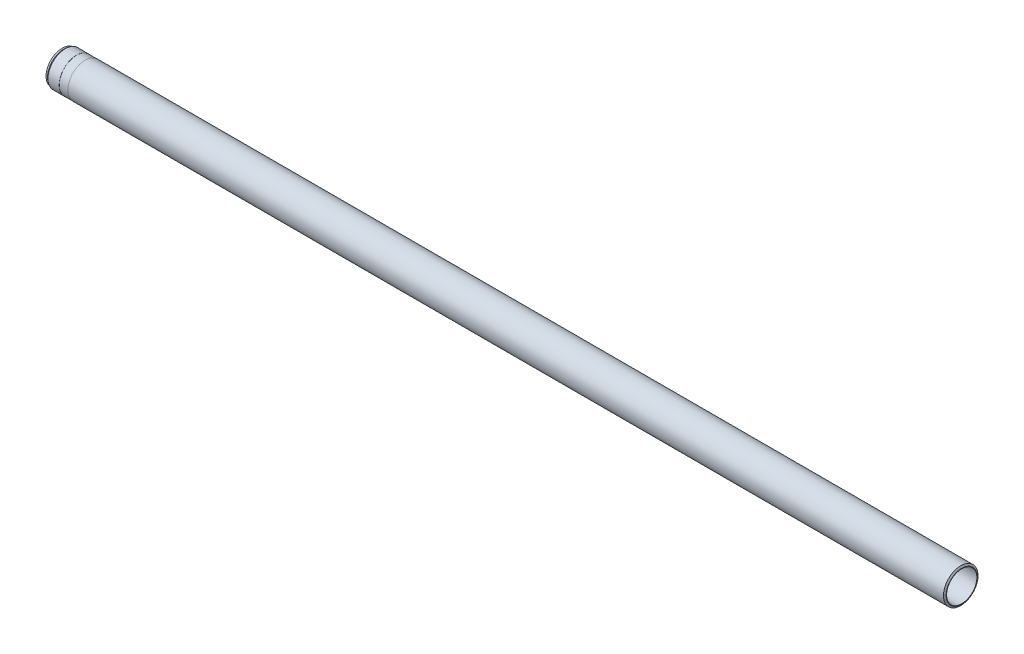
ISO-10303-21;
HEADER;
FILE_DESCRIPTION(('STEP AP214'),'2;1');
FILE_NAME('part.step','',(''),(''),'','','');
FILE_SCHEMA(('AUTOMOTIVE_DESIGN { 1 0 10303 214 1 1 1 1 }'));
ENDSEC;
DATA;
#1=APPLICATION_CONTEXT('core data for automotive mechanical design processes');
#2=APPLICATION_PROTOCOL_DEFINITION('international standard','automotive_design',2000,#1);
#3=PRODUCT_CONTEXT('',#1,'mechanical');
#4=PRODUCT('Part','Part','',(#3));
#5=PRODUCT_RELATED_PRODUCT_CATEGORY('part','',(#4));
#6=PRODUCT_DEFINITION_FORMATION('','',#4);
#7=PRODUCT_DEFINITION_CONTEXT('part definition',#1,'design');
#8=PRODUCT_DEFINITION('design','',#6,#7);
#9=PRODUCT_DEFINITION_SHAPE('','',#8);
#10=(LENGTH_UNIT() NAMED_UNIT(*) SI_UNIT(.MILLI.,.METRE.));
#11=(NAMED_UNIT(*) PLANE_ANGLE_UNIT() SI_UNIT($,.RADIAN.));
#12=(NAMED_UNIT(*) SI_UNIT($,.STERADIAN.) SOLID_ANGLE_UNIT());
#13=UNCERTAINTY_MEASURE_WITH_UNIT(LENGTH_MEASURE(1.E-05),#10,'distance_accuracy_value','');
#14=(GEOMETRIC_REPRESENTATION_CONTEXT(3) GLOBAL_UNCERTAINTY_ASSIGNED_CONTEXT((#13)) GLOBAL_UNIT_ASSIGNED_CONTEXT((#10,
#11,#12)) REPRESENTATION_CONTEXT('',''));
#15=CARTESIAN_POINT('',(0.,0.,0.));
#16=DIRECTION('',(0.,0.,1.));
#17=DIRECTION('',(1.,0.,0.));
#18=AXIS2_PLACEMENT_3D('',#15,#16,#17);
#19=CARTESIAN_POINT('',(0.,0.,0.));
#20=DIRECTION('',(-1.,0.,0.));
#21=DIRECTION('',(0.,0.,1.));
#22=AXIS2_PLACEMENT_3D('',#19,#20,#21);
#23=CONICAL_SURFACE('',#22,36.,1.0471975511966);
#24=CARTESIAN_POINT('',(-2.30940107675881,0.,0.));
#25=DIRECTION('',(-1.,0.,0.));
#26=DIRECTION('',(0.,0.,1.));
#27=AXIS2_PLACEMENT_3D('',#24,#25,#26);
#28=CIRCLE('',#27,40.);
#29=CARTESIAN_POINT('',(-2.30940107675882,0.,40.));
#30=VERTEX_POINT('',#29);
#31=EDGE_CURVE('E10',#30,#30,#28,.T.);
#32=ORIENTED_EDGE('',*,*,#31,.F.);
#33=EDGE_LOOP('',(#32));
#34=FACE_BOUND('',#33,.T.);
#35=CARTESIAN_POINT('',(0.,0.,0.));
#36=DIRECTION('',(-1.,0.,0.));
#37=DIRECTION('',(0.,0.,1.));
#38=AXIS2_PLACEMENT_3D('',#35,#36,#37);
#39=CIRCLE('',#38,36.);
#40=CARTESIAN_POINT('',(0.,0.,36.));
#41=VERTEX_POINT('',#40);
#42=EDGE_CURVE('E87',#41,#41,#39,.T.);
#43=ORIENTED_EDGE('',*,*,#42,.T.);
#44=EDGE_LOOP('',(#43));
#45=FACE_BOUND('',#44,.T.);
#46=ADVANCED_FACE('F41',(#34,#45),#23,.T.);
#47=CARTESIAN_POINT('',(-122.784188741722,0.,0.));
#48=DIRECTION('',(-1.,0.,0.));
#49=DIRECTION('',(0.,0.,1.));
#50=AXIS2_PLACEMENT_3D('',#47,#48,#49);
#51=CYLINDRICAL_SURFACE('',#50,39.9999999999999);
#52=CARTESIAN_POINT('',(-2028.,0.,4.20218248886714E-13));
#53=DIRECTION('',(-1.,0.,0.));
#54=DIRECTION('',(0.,0.,1.));
#55=AXIS2_PLACEMENT_3D('',#52,#53,#54);
#56=CIRCLE('',#55,39.9999999999998);
#57=CARTESIAN_POINT('',(-2028.,0.,40.0000000000002));
#58=VERTEX_POINT('',#57);
#59=EDGE_CURVE('E47',#58,#58,#56,.T.);
#60=ORIENTED_EDGE('',*,*,#59,.F.);
#61=EDGE_LOOP('',(#60));
#62=FACE_BOUND('',#61,.T.);
#63=ORIENTED_EDGE('',*,*,#31,.T.);
#64=EDGE_LOOP('',(#63));
#65=FACE_BOUND('',#64,.T.);
#66=ADVANCED_FACE('F160',(#62,#65),#51,.T.);
#67=CARTESIAN_POINT('',(-2028.,39.9999999999997,3.9357289629571E-13));
#68=DIRECTION('',(1.,0.,0.));
#69=DIRECTION('',(0.,0.,-1.));
#70=AXIS2_PLACEMENT_3D('',#67,#68,#69);
#71=PLANE('',#70);
#72=CARTESIAN_POINT('',(-2028.,0.,4.20218248886714E-13));
#73=DIRECTION('',(-1.,0.,0.));
#74=DIRECTION('',(0.,0.,1.));
#75=AXIS2_PLACEMENT_3D('',#72,#73,#74);
#76=CIRCLE('',#75,39.75);
#77=CARTESIAN_POINT('',(-2028.,0.,39.7500000000004));
#78=VERTEX_POINT('',#77);
#79=EDGE_CURVE('E51',#78,#78,#76,.T.);
#80=ORIENTED_EDGE('',*,*,#79,.F.);
#81=EDGE_LOOP('',(#80));
#82=FACE_BOUND('',#81,.T.);
#83=ORIENTED_EDGE('',*,*,#59,.T.);
#84=EDGE_LOOP('',(#83));
#85=FACE_BOUND('',#84,.T.);
#86=ADVANCED_FACE('F155',(#82,#85),#71,.F.);
#87=CARTESIAN_POINT('',(-122.784188741722,0.,0.));
#88=DIRECTION('',(-1.,0.,0.));
#89=DIRECTION('',(0.,0.,1.));
#90=AXIS2_PLACEMENT_3D('',#87,#88,#89);
#91=CYLINDRICAL_SURFACE('',#90,39.75);
#92=CARTESIAN_POINT('',(-2048.,0.,4.24362413076918E-13));
#93=DIRECTION('',(-1.,0.,0.));
#94=DIRECTION('',(0.,0.,1.));
#95=AXIS2_PLACEMENT_3D('',#92,#93,#94);
#96=CIRCLE('',#95,39.75);
#97=CARTESIAN_POINT('',(-2048.,0.,39.7500000000004));
#98=VERTEX_POINT('',#97);
#99=EDGE_CURVE('E55',#98,#98,#96,.T.);
#100=ORIENTED_EDGE('',*,*,#99,.F.);
#101=EDGE_LOOP('',(#100));
#102=FACE_BOUND('',#101,.T.);
#103=ORIENTED_EDGE('',*,*,#79,.T.);
#104=EDGE_LOOP('',(#103));
#105=FACE_BOUND('',#104,.T.);
#106=ADVANCED_FACE('F149',(#102,#105),#91,.T.);
#107=CARTESIAN_POINT('',(-2048.,39.75,3.97883593939608E-13));
#108=DIRECTION('',(-1.,0.,0.));
#109=DIRECTION('',(0.,0.,1.));
#110=AXIS2_PLACEMENT_3D('',#107,#108,#109);
#111=PLANE('',#110);
#112=CARTESIAN_POINT('',(-2048.,0.,4.24362413076918E-13));
#113=DIRECTION('',(-1.,0.,0.));
#114=DIRECTION('',(0.,0.,1.));
#115=AXIS2_PLACEMENT_3D('',#112,#113,#114);
#116=CIRCLE('',#115,39.9999999999998);
#117=CARTESIAN_POINT('',(-2048.,0.,40.0000000000002));
#118=VERTEX_POINT('',#117);
#119=EDGE_CURVE('E60',#118,#118,#116,.T.);
#120=ORIENTED_EDGE('',*,*,#119,.F.);
#121=EDGE_LOOP('',(#120));
#122=FACE_BOUND('',#121,.T.);
#123=ORIENTED_EDGE('',*,*,#99,.T.);
#124=EDGE_LOOP('',(#123));
#125=FACE_BOUND('',#124,.T.);
#126=ADVANCED_FACE('F143',(#122,#125),#111,.F.);
#127=CARTESIAN_POINT('',(-122.784188741722,0.,0.));
#128=DIRECTION('',(-1.,0.,0.));
#129=DIRECTION('',(0.,0.,1.));
#130=AXIS2_PLACEMENT_3D('',#127,#128,#129);
#131=CYLINDRICAL_SURFACE('',#130,39.9999999999998);
#132=CARTESIAN_POINT('',(-2073.92962998314,0.,4.29735245278988E-13));
#133=DIRECTION('',(-1.,0.,0.));
#134=DIRECTION('',(0.,0.,1.));
#135=AXIS2_PLACEMENT_3D('',#132,#133,#134);
#136=CIRCLE('',#135,39.9999999999998);
#137=CARTESIAN_POINT('',(-2073.92962998314,0.,40.0000000000002));
#138=VERTEX_POINT('',#137);
#139=EDGE_CURVE('E63',#138,#138,#136,.T.);
#140=ORIENTED_EDGE('',*,*,#139,.F.);
#141=EDGE_LOOP('',(#140));
#142=FACE_BOUND('',#141,.T.);
#143=ORIENTED_EDGE('',*,*,#119,.T.);
#144=EDGE_LOOP('',(#143));
#145=FACE_BOUND('',#144,.T.);
#146=ADVANCED_FACE('F137',(#142,#145),#131,.T.);
#147=CARTESIAN_POINT('',(-2073.92962998314,0.,4.29735245278988E-13));
#148=DIRECTION('',(1.,0.,0.));
#149=DIRECTION('',(0.,0.,-1.));
#150=AXIS2_PLACEMENT_3D('',#147,#148,#149);
#151=CONICAL_SURFACE('',#150,39.9999999999998,0.610865238197978);
#152=CARTESIAN_POINT('',(-2077.5,0.,4.30475055257469E-13));
#153=DIRECTION('',(-1.,0.,0.));
#154=DIRECTION('',(0.,0.,1.));
#155=AXIS2_PLACEMENT_3D('',#152,#153,#154);
#156=CIRCLE('',#155,37.5);
#157=CARTESIAN_POINT('',(-2077.5,0.,37.5000000000004));
#158=VERTEX_POINT('',#157);
#159=EDGE_CURVE('E66',#158,#158,#156,.T.);
#160=ORIENTED_EDGE('',*,*,#159,.F.);
#161=EDGE_LOOP('',(#160));
#162=FACE_BOUND('',#161,.T.);
#163=ORIENTED_EDGE('',*,*,#139,.T.);
#164=EDGE_LOOP('',(#163));
#165=FACE_BOUND('',#164,.T.);
#166=ADVANCED_FACE('F131',(#162,#165),#151,.T.);
#167=CARTESIAN_POINT('',(-122.784188741722,0.,0.));
#168=DIRECTION('',(-1.,0.,0.));
#169=DIRECTION('',(0.,0.,1.));
#170=AXIS2_PLACEMENT_3D('',#167,#168,#169);
#171=CYLINDRICAL_SURFACE('',#170,37.5);
#172=CARTESIAN_POINT('',(-2081.,0.,4.31200283990755E-13));
#173=DIRECTION('',(-1.,0.,0.));
#174=DIRECTION('',(0.,0.,1.));
#175=AXIS2_PLACEMENT_3D('',#172,#173,#174);
#176=CIRCLE('',#175,37.5);
#177=CARTESIAN_POINT('',(-2081.,0.,37.5000000000004));
#178=VERTEX_POINT('',#177);
#179=EDGE_CURVE('E69',#178,#178,#176,.T.);
#180=ORIENTED_EDGE('',*,*,#179,.F.);
#181=EDGE_LOOP('',(#180));
#182=FACE_BOUND('',#181,.T.);
#183=ORIENTED_EDGE('',*,*,#159,.T.);
#184=EDGE_LOOP('',(#183));
#185=FACE_BOUND('',#184,.T.);
#186=ADVANCED_FACE('F125',(#182,#185),#171,.T.);
#187=CARTESIAN_POINT('',(-2081.,37.5,4.06220265936689E-13));
#188=DIRECTION('',(1.,0.,0.));
#189=DIRECTION('',(0.,0.,-1.));
#190=AXIS2_PLACEMENT_3D('',#187,#188,#189);
#191=PLANE('',#190);
#192=CARTESIAN_POINT('',(-2081.,0.,4.31200283990755E-13));
#193=DIRECTION('',(-1.,0.,0.));
#194=DIRECTION('',(0.,0.,1.));
#195=AXIS2_PLACEMENT_3D('',#192,#193,#194);
#196=CIRCLE('',#195,35.7273502691896);
#197=CARTESIAN_POINT('',(-2081.,0.,35.72735026919));
#198=VERTEX_POINT('',#197);
#199=EDGE_CURVE('E72',#198,#198,#196,.T.);
#200=ORIENTED_EDGE('',*,*,#199,.F.);
#201=EDGE_LOOP('',(#200));
#202=FACE_BOUND('',#201,.T.);
#203=ORIENTED_EDGE('',*,*,#179,.T.);
#204=EDGE_LOOP('',(#203));
#205=FACE_BOUND('',#204,.T.);
#206=ADVANCED_FACE('F119',(#202,#205),#191,.F.);
#207=CARTESIAN_POINT('',(-2081.,0.,4.31200283990755E-13));
#208=DIRECTION('',(-1.,0.,0.));
#209=DIRECTION('',(0.,0.,1.));
#210=AXIS2_PLACEMENT_3D('',#207,#208,#209);
#211=CONICAL_SURFACE('',#210,35.7273502691896,0.5235987755983);
#212=CARTESIAN_POINT('',(-2080.,0.,4.30993075781244E-13));
#213=DIRECTION('',(-1.,0.,0.));
#214=DIRECTION('',(0.,0.,1.));
#215=AXIS2_PLACEMENT_3D('',#212,#213,#214);
#216=CIRCLE('',#215,35.15);
#217=CARTESIAN_POINT('',(-2080.,0.,35.1500000000004));
#218=VERTEX_POINT('',#217);
#219=EDGE_CURVE('E75',#218,#218,#216,.T.);
#220=ORIENTED_EDGE('',*,*,#219,.F.);
#221=EDGE_LOOP('',(#220));
#222=FACE_BOUND('',#221,.T.);
#223=ORIENTED_EDGE('',*,*,#199,.T.);
#224=EDGE_LOOP('',(#223));
#225=FACE_BOUND('',#224,.T.);
#226=ADVANCED_FACE('F113',(#222,#225),#211,.F.);
#227=CARTESIAN_POINT('',(-122.784188741722,0.,0.));
#228=DIRECTION('',(-1.,0.,0.));
#229=DIRECTION('',(0.,0.,1.));
#230=AXIS2_PLACEMENT_3D('',#227,#228,#229);
#231=CYLINDRICAL_SURFACE('',#230,35.15);
#232=CARTESIAN_POINT('',(-2066.,0.,4.28092160848101E-13));
#233=DIRECTION('',(-1.,0.,0.));
#234=DIRECTION('',(0.,0.,1.));
#235=AXIS2_PLACEMENT_3D('',#232,#233,#234);
#236=CIRCLE('',#235,35.15);
#237=CARTESIAN_POINT('',(-2066.,0.,35.1500000000004));
#238=VERTEX_POINT('',#237);
#239=EDGE_CURVE('E78',#238,#238,#236,.T.);
#240=ORIENTED_EDGE('',*,*,#239,.F.);
#241=EDGE_LOOP('',(#240));
#242=FACE_BOUND('',#241,.T.);
#243=ORIENTED_EDGE('',*,*,#219,.T.);
#244=EDGE_LOOP('',(#243));
#245=FACE_BOUND('',#244,.T.);
#246=ADVANCED_FACE('F107',(#242,#245),#231,.F.);
#247=CARTESIAN_POINT('',(-2066.,0.,4.28092160848101E-13));
#248=DIRECTION('',(-1.,0.,0.));
#249=DIRECTION('',(0.,0.,1.));
#250=AXIS2_PLACEMENT_3D('',#247,#248,#249);
#251=CONICAL_SURFACE('',#250,35.15,0.523598775597956);
#252=CARTESIAN_POINT('',(-2065.74019237886,0.,4.28038326576109E-13));
#253=DIRECTION('',(-1.,0.,0.));
#254=DIRECTION('',(0.,0.,1.));
#255=AXIS2_PLACEMENT_3D('',#252,#253,#254);
#256=CIRCLE('',#255,35.);
#257=CARTESIAN_POINT('',(-2065.74019237886,0.,35.0000000000004));
#258=VERTEX_POINT('',#257);
#259=EDGE_CURVE('E81',#258,#258,#256,.T.);
#260=ORIENTED_EDGE('',*,*,#259,.F.);
#261=EDGE_LOOP('',(#260));
#262=FACE_BOUND('',#261,.T.);
#263=ORIENTED_EDGE('',*,*,#239,.T.);
#264=EDGE_LOOP('',(#263));
#265=FACE_BOUND('',#264,.T.);
#266=ADVANCED_FACE('F101',(#262,#265),#251,.F.);
#267=CARTESIAN_POINT('',(-122.784188741722,0.,0.));
#268=DIRECTION('',(-1.,0.,0.));
#269=DIRECTION('',(0.,0.,1.));
#270=AXIS2_PLACEMENT_3D('',#267,#268,#269);
#271=CYLINDRICAL_SURFACE('',#270,35.);
#272=CARTESIAN_POINT('',(0.,0.,0.));
#273=DIRECTION('',(-1.,0.,0.));
#274=DIRECTION('',(0.,0.,1.));
#275=AXIS2_PLACEMENT_3D('',#272,#273,#274);
#276=CIRCLE('',#275,35.);
#277=CARTESIAN_POINT('',(0.,0.,35.));
#278=VERTEX_POINT('',#277);
#279=EDGE_CURVE('E84',#278,#278,#276,.T.);
#280=ORIENTED_EDGE('',*,*,#279,.F.);
#281=EDGE_LOOP('',(#280));
#282=FACE_BOUND('',#281,.T.);
#283=ORIENTED_EDGE('',*,*,#259,.T.);
#284=EDGE_LOOP('',(#283));
#285=FACE_BOUND('',#284,.T.);
#286=ADVANCED_FACE('F95',(#282,#285),#271,.F.);
#287=CARTESIAN_POINT('',(0.,35.,0.));
#288=DIRECTION('',(-1.,0.,0.));
#289=DIRECTION('',(0.,0.,1.));
#290=AXIS2_PLACEMENT_3D('',#287,#288,#289);
#291=PLANE('',#290);
#292=ORIENTED_EDGE('',*,*,#42,.F.);
#293=EDGE_LOOP('',(#292));
#294=FACE_BOUND('',#293,.T.);
#295=ORIENTED_EDGE('',*,*,#279,.T.);
#296=EDGE_LOOP('',(#295));
#297=FACE_BOUND('',#296,.T.);
#298=ADVANCED_FACE('F92',(#294,#297),#291,.F.);
#299=CLOSED_SHELL('',(#46,#66,#86,#106,#126,#146,#166,#186,#206,#226,#246,#266,#286,#298));
#300=MANIFOLD_SOLID_BREP('B2',#299);
#301=ADVANCED_BREP_SHAPE_REPRESENTATION('',(#18,#300),#14);
#302=SHAPE_DEFINITION_REPRESENTATION(#9,#301);
ENDSEC;
END-ISO-10303-21;
